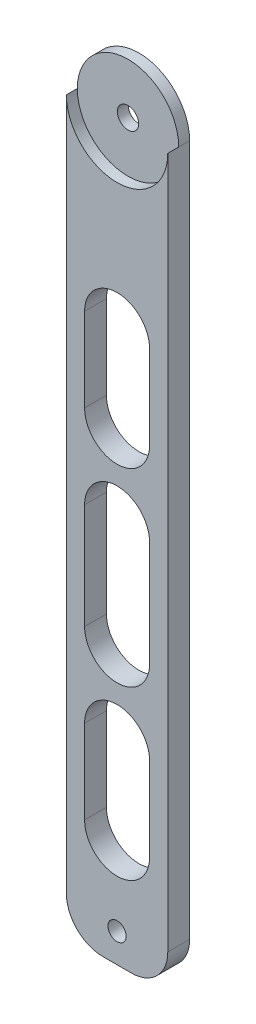
ISO-10303-21;
HEADER;
FILE_DESCRIPTION(('STEP AP214'),'2;1');
FILE_NAME('part.step','',(''),(''),'','','');
FILE_SCHEMA(('AUTOMOTIVE_DESIGN { 1 0 10303 214 1 1 1 1 }'));
ENDSEC;
DATA;
#1=APPLICATION_CONTEXT('core data for automotive mechanical design processes');
#2=APPLICATION_PROTOCOL_DEFINITION('international standard','automotive_design',2000,#1);
#3=PRODUCT_CONTEXT('',#1,'mechanical');
#4=PRODUCT('Part','Part','',(#3));
#5=PRODUCT_RELATED_PRODUCT_CATEGORY('part','',(#4));
#6=PRODUCT_DEFINITION_FORMATION('','',#4);
#7=PRODUCT_DEFINITION_CONTEXT('part definition',#1,'design');
#8=PRODUCT_DEFINITION('design','',#6,#7);
#9=PRODUCT_DEFINITION_SHAPE('','',#8);
#10=(LENGTH_UNIT() NAMED_UNIT(*) SI_UNIT(.MILLI.,.METRE.));
#11=(NAMED_UNIT(*) PLANE_ANGLE_UNIT() SI_UNIT($,.RADIAN.));
#12=(NAMED_UNIT(*) SI_UNIT($,.STERADIAN.) SOLID_ANGLE_UNIT());
#13=UNCERTAINTY_MEASURE_WITH_UNIT(LENGTH_MEASURE(1.E-05),#10,'distance_accuracy_value','');
#14=(GEOMETRIC_REPRESENTATION_CONTEXT(3) GLOBAL_UNCERTAINTY_ASSIGNED_CONTEXT((#13)) GLOBAL_UNIT_ASSIGNED_CONTEXT((#10,
#11,#12)) REPRESENTATION_CONTEXT('',''));
#15=CARTESIAN_POINT('',(0.,0.,0.));
#16=DIRECTION('',(0.,0.,1.));
#17=DIRECTION('',(1.,0.,0.));
#18=AXIS2_PLACEMENT_3D('',#15,#16,#17);
#19=CARTESIAN_POINT('',(5.76007751937987,-168.788662790698,6.));
#20=DIRECTION('',(0.,0.,1.));
#21=DIRECTION('',(1.,0.,0.));
#22=AXIS2_PLACEMENT_3D('',#19,#20,#21);
#23=CYLINDRICAL_SURFACE('',#22,10.);
#24=DIRECTION('',(0.,0.,-1.));
#25=VECTOR('',#24,1.);
#26=CARTESIAN_POINT('',(15.7600775193799,-168.788662790698,6.));
#27=LINE('',#26,#25);
#28=CARTESIAN_POINT('',(15.7600775193799,-168.788662790698,6.));
#29=VERTEX_POINT('',#28);
#30=CARTESIAN_POINT('',(15.7600775193799,-168.788662790698,0.));
#31=VERTEX_POINT('',#30);
#32=EDGE_CURVE('E323',#29,#31,#27,.T.);
#33=ORIENTED_EDGE('',*,*,#32,.F.);
#34=CARTESIAN_POINT('',(5.76007751937987,-168.788662790698,6.));
#35=DIRECTION('',(0.,0.,1.));
#36=DIRECTION('',(1.,0.,0.));
#37=AXIS2_PLACEMENT_3D('',#34,#35,#36);
#38=CIRCLE('',#37,10.);
#39=CARTESIAN_POINT('',(5.76007751937987,-178.788662790698,6.));
#40=VERTEX_POINT('',#39);
#41=EDGE_CURVE('E42',#40,#29,#38,.T.);
#42=ORIENTED_EDGE('',*,*,#41,.F.);
#43=DIRECTION('',(0.,0.,-1.));
#44=VECTOR('',#43,1.);
#45=CARTESIAN_POINT('',(5.76007751937987,-178.788662790698,6.));
#46=LINE('',#45,#44);
#47=CARTESIAN_POINT('',(5.76007751937987,-178.788662790698,0.));
#48=VERTEX_POINT('',#47);
#49=EDGE_CURVE('E326',#48,#40,#46,.F.);
#50=ORIENTED_EDGE('',*,*,#49,.F.);
#51=CARTESIAN_POINT('',(5.76007751937987,-168.788662790698,0.));
#52=DIRECTION('',(0.,0.,1.));
#53=DIRECTION('',(1.,0.,0.));
#54=AXIS2_PLACEMENT_3D('',#51,#52,#53);
#55=CIRCLE('',#54,10.);
#56=EDGE_CURVE('E11',#31,#48,#55,.F.);
#57=ORIENTED_EDGE('',*,*,#56,.F.);
#58=EDGE_LOOP('',(#33,#42,#50,#57));
#59=FACE_BOUND('',#58,.T.);
#60=ADVANCED_FACE('F35',(#59),#23,.T.);
#61=CARTESIAN_POINT('',(-2.08992248062013,-168.788662790698,6.));
#62=DIRECTION('',(0.,0.,1.));
#63=DIRECTION('',(1.,0.,0.));
#64=AXIS2_PLACEMENT_3D('',#61,#62,#63);
#65=CYLINDRICAL_SURFACE('',#64,10.);
#66=DIRECTION('',(0.,0.,1.));
#67=VECTOR('',#66,1.);
#68=CARTESIAN_POINT('',(-12.0899224806201,-168.788662790698,6.));
#69=LINE('',#68,#67);
#70=CARTESIAN_POINT('',(-12.0899224806201,-168.788662790698,0.));
#71=VERTEX_POINT('',#70);
#72=CARTESIAN_POINT('',(-12.0899224806201,-168.788662790698,6.));
#73=VERTEX_POINT('',#72);
#74=EDGE_CURVE('E313',#71,#73,#69,.T.);
#75=ORIENTED_EDGE('',*,*,#74,.F.);
#76=CARTESIAN_POINT('',(-2.08992248062013,-168.788662790698,0.));
#77=DIRECTION('',(0.,0.,1.));
#78=DIRECTION('',(1.,0.,0.));
#79=AXIS2_PLACEMENT_3D('',#76,#77,#78);
#80=CIRCLE('',#79,10.);
#81=CARTESIAN_POINT('',(-2.08992248062013,-178.788662790698,0.));
#82=VERTEX_POINT('',#81);
#83=EDGE_CURVE('E319',#82,#71,#80,.F.);
#84=ORIENTED_EDGE('',*,*,#83,.F.);
#85=DIRECTION('',(0.,0.,1.));
#86=VECTOR('',#85,1.);
#87=CARTESIAN_POINT('',(-2.08992248062013,-178.788662790698,6.));
#88=LINE('',#87,#86);
#89=CARTESIAN_POINT('',(-2.08992248062013,-178.788662790698,6.));
#90=VERTEX_POINT('',#89);
#91=EDGE_CURVE('E316',#90,#82,#88,.F.);
#92=ORIENTED_EDGE('',*,*,#91,.F.);
#93=CARTESIAN_POINT('',(-2.08992248062013,-168.788662790698,6.));
#94=DIRECTION('',(0.,0.,1.));
#95=DIRECTION('',(1.,0.,0.));
#96=AXIS2_PLACEMENT_3D('',#93,#94,#95);
#97=CIRCLE('',#96,10.);
#98=EDGE_CURVE('E321',#73,#90,#97,.T.);
#99=ORIENTED_EDGE('',*,*,#98,.F.);
#100=EDGE_LOOP('',(#75,#84,#92,#99));
#101=FACE_BOUND('',#100,.T.);
#102=ADVANCED_FACE('F354',(#101),#65,.T.);
#103=CARTESIAN_POINT('',(0.,0.,6.));
#104=DIRECTION('',(0.,0.,1.));
#105=DIRECTION('',(1.,0.,0.));
#106=AXIS2_PLACEMENT_3D('',#103,#104,#105);
#107=PLANE('',#106);
#108=CARTESIAN_POINT('',(1.83507751937984,-125.788662790698,6.));
#109=DIRECTION('',(0.,0.,1.));
#110=DIRECTION('',(1.,0.,0.));
#111=AXIS2_PLACEMENT_3D('',#108,#109,#110);
#112=CIRCLE('',#111,8.925);
#113=CARTESIAN_POINT('',(10.7600775193798,-125.788662790698,6.));
#114=VERTEX_POINT('',#113);
#115=CARTESIAN_POINT('',(-7.08992248062015,-125.788662790698,6.));
#116=VERTEX_POINT('',#115);
#117=EDGE_CURVE('E184',#114,#116,#112,.T.);
#118=ORIENTED_EDGE('',*,*,#117,.F.);
#119=DIRECTION('',(0.,-1.,0.));
#120=VECTOR('',#119,1.);
#121=CARTESIAN_POINT('',(10.7600775193798,0.,6.));
#122=LINE('',#121,#120);
#123=CARTESIAN_POINT('',(10.7600775193798,-148.788662790698,6.));
#124=VERTEX_POINT('',#123);
#125=EDGE_CURVE('E189',#114,#124,#122,.T.);
#126=ORIENTED_EDGE('',*,*,#125,.T.);
#127=CARTESIAN_POINT('',(1.83507751937985,-148.788662790698,6.));
#128=DIRECTION('',(0.,0.,1.));
#129=DIRECTION('',(1.,0.,0.));
#130=AXIS2_PLACEMENT_3D('',#127,#128,#129);
#131=CIRCLE('',#130,8.925);
#132=CARTESIAN_POINT('',(-7.08992248062015,-148.788662790698,6.));
#133=VERTEX_POINT('',#132);
#134=EDGE_CURVE('E168',#133,#124,#131,.T.);
#135=ORIENTED_EDGE('',*,*,#134,.F.);
#136=DIRECTION('',(0.,-1.,0.));
#137=VECTOR('',#136,1.);
#138=CARTESIAN_POINT('',(-7.08992248062018,0.,6.));
#139=LINE('',#138,#137);
#140=EDGE_CURVE('E179',#116,#133,#139,.T.);
#141=ORIENTED_EDGE('',*,*,#140,.F.);
#142=EDGE_LOOP('',(#118,#126,#135,#141));
#143=FACE_BOUND('',#142,.T.);
#144=CARTESIAN_POINT('',(1.83507751937984,-27.7886627906977,6.));
#145=DIRECTION('',(0.,0.,1.));
#146=DIRECTION('',(1.,0.,0.));
#147=AXIS2_PLACEMENT_3D('',#144,#145,#146);
#148=CIRCLE('',#147,8.925);
#149=CARTESIAN_POINT('',(10.7600775193798,-27.7886627906977,6.));
#150=VERTEX_POINT('',#149);
#151=CARTESIAN_POINT('',(-7.08992248062015,-27.7886627906977,6.));
#152=VERTEX_POINT('',#151);
#153=EDGE_CURVE('E213',#150,#152,#148,.T.);
#154=ORIENTED_EDGE('',*,*,#153,.F.);
#155=DIRECTION('',(0.,-1.,0.));
#156=VECTOR('',#155,1.);
#157=CARTESIAN_POINT('',(10.7600775193798,0.,6.));
#158=LINE('',#157,#156);
#159=CARTESIAN_POINT('',(10.7600775193798,-50.7886627906977,6.));
#160=VERTEX_POINT('',#159);
#161=EDGE_CURVE('E227',#150,#160,#158,.T.);
#162=ORIENTED_EDGE('',*,*,#161,.T.);
#163=CARTESIAN_POINT('',(1.83507751937985,-50.7886627906977,6.));
#164=DIRECTION('',(0.,0.,1.));
#165=DIRECTION('',(1.,0.,0.));
#166=AXIS2_PLACEMENT_3D('',#163,#164,#165);
#167=CIRCLE('',#166,8.925);
#168=CARTESIAN_POINT('',(-7.08992248062015,-50.7886627906977,6.));
#169=VERTEX_POINT('',#168);
#170=EDGE_CURVE('E224',#169,#160,#167,.T.);
#171=ORIENTED_EDGE('',*,*,#170,.F.);
#172=DIRECTION('',(0.,-1.,0.));
#173=VECTOR('',#172,1.);
#174=CARTESIAN_POINT('',(-7.08992248062016,0.,6.));
#175=LINE('',#174,#173);
#176=EDGE_CURVE('E221',#152,#169,#175,.T.);
#177=ORIENTED_EDGE('',*,*,#176,.F.);
#178=EDGE_LOOP('',(#154,#162,#171,#177));
#179=FACE_BOUND('',#178,.T.);
#180=DIRECTION('',(1.,0.,0.));
#181=VECTOR('',#180,1.);
#182=CARTESIAN_POINT('',(0.,-178.788662790698,6.));
#183=LINE('',#182,#181);
#184=EDGE_CURVE('E263',#90,#40,#183,.T.);
#185=ORIENTED_EDGE('',*,*,#184,.T.);
#186=ORIENTED_EDGE('',*,*,#41,.T.);
#187=DIRECTION('',(0.,-1.,0.));
#188=VECTOR('',#187,1.);
#189=CARTESIAN_POINT('',(15.7600775193798,0.,6.));
#190=LINE('',#189,#188);
#191=CARTESIAN_POINT('',(15.7600775193798,21.2113372093023,6.));
#192=VERTEX_POINT('',#191);
#193=EDGE_CURVE('E256',#192,#29,#190,.T.);
#194=ORIENTED_EDGE('',*,*,#193,.F.);
#195=CARTESIAN_POINT('',(1.83507751937984,21.2113372093023,6.));
#196=DIRECTION('',(0.,0.,1.));
#197=DIRECTION('',(1.,0.,0.));
#198=AXIS2_PLACEMENT_3D('',#195,#196,#197);
#199=CIRCLE('',#198,13.925);
#200=CARTESIAN_POINT('',(-12.0899224806202,21.2113372093023,6.));
#201=VERTEX_POINT('',#200);
#202=EDGE_CURVE('E282',#201,#192,#199,.T.);
#203=ORIENTED_EDGE('',*,*,#202,.F.);
#204=DIRECTION('',(0.,-1.,0.));
#205=VECTOR('',#204,1.);
#206=CARTESIAN_POINT('',(-12.0899224806202,0.,6.));
#207=LINE('',#206,#205);
#208=EDGE_CURVE('E259',#201,#73,#207,.T.);
#209=ORIENTED_EDGE('',*,*,#208,.T.);
#210=ORIENTED_EDGE('',*,*,#98,.T.);
#211=EDGE_LOOP('',(#185,#186,#194,#203,#209,#210));
#212=FACE_BOUND('',#211,.T.);
#213=CARTESIAN_POINT('',(1.83507751937984,-170.788662790698,6.));
#214=DIRECTION('',(0.,0.,1.));
#215=DIRECTION('',(1.,0.,0.));
#216=AXIS2_PLACEMENT_3D('',#213,#214,#215);
#217=CIRCLE('',#216,2.5);
#218=CARTESIAN_POINT('',(4.33507751937984,-170.788662790698,6.));
#219=VERTEX_POINT('',#218);
#220=EDGE_CURVE('E249',#219,#219,#217,.T.);
#221=ORIENTED_EDGE('',*,*,#220,.F.);
#222=EDGE_LOOP('',(#221));
#223=FACE_BOUND('',#222,.T.);
#224=DIRECTION('',(0.,-1.,0.));
#225=VECTOR('',#224,1.);
#226=CARTESIAN_POINT('',(-7.08992248062017,0.,6.));
#227=LINE('',#226,#225);
#228=CARTESIAN_POINT('',(-7.08992248062015,-73.7886627906977,6.));
#229=VERTEX_POINT('',#228);
#230=CARTESIAN_POINT('',(-7.08992248062015,-102.788662790698,6.));
#231=VERTEX_POINT('',#230);
#232=EDGE_CURVE('E201',#229,#231,#227,.T.);
#233=ORIENTED_EDGE('',*,*,#232,.F.);
#234=CARTESIAN_POINT('',(1.83507751937984,-73.7886627906977,6.));
#235=DIRECTION('',(0.,0.,1.));
#236=DIRECTION('',(1.,0.,0.));
#237=AXIS2_PLACEMENT_3D('',#234,#235,#236);
#238=CIRCLE('',#237,8.925);
#239=CARTESIAN_POINT('',(10.7600775193798,-73.7886627906977,6.));
#240=VERTEX_POINT('',#239);
#241=EDGE_CURVE('E196',#229,#240,#238,.F.);
#242=ORIENTED_EDGE('',*,*,#241,.T.);
#243=DIRECTION('',(0.,-1.,0.));
#244=VECTOR('',#243,1.);
#245=CARTESIAN_POINT('',(10.7600775193798,0.,6.));
#246=LINE('',#245,#244);
#247=CARTESIAN_POINT('',(10.7600775193798,-102.788662790698,6.));
#248=VERTEX_POINT('',#247);
#249=EDGE_CURVE('E207',#240,#248,#246,.T.);
#250=ORIENTED_EDGE('',*,*,#249,.T.);
#251=CARTESIAN_POINT('',(1.83507751937985,-102.788662790698,6.));
#252=DIRECTION('',(0.,0.,1.));
#253=DIRECTION('',(1.,0.,0.));
#254=AXIS2_PLACEMENT_3D('',#251,#252,#253);
#255=CIRCLE('',#254,8.925);
#256=EDGE_CURVE('E204',#231,#248,#255,.T.);
#257=ORIENTED_EDGE('',*,*,#256,.F.);
#258=EDGE_LOOP('',(#233,#242,#250,#257));
#259=FACE_BOUND('',#258,.T.);
#260=ADVANCED_FACE('F186',(#143,#179,#212,#223,#259),#107,.T.);
#261=CARTESIAN_POINT('',(0.,0.,0.));
#262=DIRECTION('',(0.,0.,1.));
#263=DIRECTION('',(1.,0.,0.));
#264=AXIS2_PLACEMENT_3D('',#261,#262,#263);
#265=PLANE('',#264);
#266=DIRECTION('',(0.,-1.,0.));
#267=VECTOR('',#266,1.);
#268=CARTESIAN_POINT('',(10.7600775193798,0.,0.));
#269=LINE('',#268,#267);
#270=CARTESIAN_POINT('',(10.7600775193798,-125.788662790698,0.));
#271=VERTEX_POINT('',#270);
#272=CARTESIAN_POINT('',(10.7600775193798,-148.788662790698,0.));
#273=VERTEX_POINT('',#272);
#274=EDGE_CURVE('E308',#271,#273,#269,.T.);
#275=ORIENTED_EDGE('',*,*,#274,.F.);
#276=CARTESIAN_POINT('',(1.83507751937984,-125.788662790698,0.));
#277=DIRECTION('',(0.,0.,1.));
#278=DIRECTION('',(1.,0.,0.));
#279=AXIS2_PLACEMENT_3D('',#276,#277,#278);
#280=CIRCLE('',#279,8.925);
#281=CARTESIAN_POINT('',(-7.08992248062015,-125.788662790698,0.));
#282=VERTEX_POINT('',#281);
#283=EDGE_CURVE('E310',#271,#282,#280,.T.);
#284=ORIENTED_EDGE('',*,*,#283,.T.);
#285=DIRECTION('',(0.,-1.,0.));
#286=VECTOR('',#285,1.);
#287=CARTESIAN_POINT('',(-7.08992248062018,0.,0.));
#288=LINE('',#287,#286);
#289=CARTESIAN_POINT('',(-7.08992248062015,-148.788662790698,0.));
#290=VERTEX_POINT('',#289);
#291=EDGE_CURVE('E305',#282,#290,#288,.T.);
#292=ORIENTED_EDGE('',*,*,#291,.T.);
#293=CARTESIAN_POINT('',(1.83507751937985,-148.788662790698,0.));
#294=DIRECTION('',(0.,0.,1.));
#295=DIRECTION('',(1.,0.,0.));
#296=AXIS2_PLACEMENT_3D('',#293,#294,#295);
#297=CIRCLE('',#296,8.925);
#298=EDGE_CURVE('E171',#290,#273,#297,.T.);
#299=ORIENTED_EDGE('',*,*,#298,.T.);
#300=EDGE_LOOP('',(#275,#284,#292,#299));
#301=FACE_BOUND('',#300,.T.);
#302=DIRECTION('',(0.,-1.,0.));
#303=VECTOR('',#302,1.);
#304=CARTESIAN_POINT('',(15.7600775193798,0.,0.));
#305=LINE('',#304,#303);
#306=CARTESIAN_POINT('',(15.7600775193798,21.2113372093023,0.));
#307=VERTEX_POINT('',#306);
#308=EDGE_CURVE('E253',#307,#31,#305,.T.);
#309=ORIENTED_EDGE('',*,*,#308,.T.);
#310=ORIENTED_EDGE('',*,*,#56,.T.);
#311=DIRECTION('',(1.,0.,0.));
#312=VECTOR('',#311,1.);
#313=CARTESIAN_POINT('',(0.,-178.788662790698,0.));
#314=LINE('',#313,#312);
#315=EDGE_CURVE('E260',#82,#48,#314,.T.);
#316=ORIENTED_EDGE('',*,*,#315,.F.);
#317=ORIENTED_EDGE('',*,*,#83,.T.);
#318=DIRECTION('',(0.,-1.,0.));
#319=VECTOR('',#318,1.);
#320=CARTESIAN_POINT('',(-12.0899224806202,0.,0.));
#321=LINE('',#320,#319);
#322=CARTESIAN_POINT('',(-12.0899224806202,21.2113372093023,0.));
#323=VERTEX_POINT('',#322);
#324=EDGE_CURVE('E271',#323,#71,#321,.T.);
#325=ORIENTED_EDGE('',*,*,#324,.F.);
#326=CARTESIAN_POINT('',(1.83507751937984,21.2113372093023,0.));
#327=DIRECTION('',(0.,0.,1.));
#328=DIRECTION('',(1.,0.,0.));
#329=AXIS2_PLACEMENT_3D('',#326,#327,#328);
#330=CIRCLE('',#329,13.925);
#331=EDGE_CURVE('E268',#307,#323,#330,.T.);
#332=ORIENTED_EDGE('',*,*,#331,.F.);
#333=EDGE_LOOP('',(#309,#310,#316,#317,#325,#332));
#334=FACE_BOUND('',#333,.T.);
#335=CARTESIAN_POINT('',(1.83507751937984,-170.788662790698,0.));
#336=DIRECTION('',(0.,0.,1.));
#337=DIRECTION('',(1.,0.,0.));
#338=AXIS2_PLACEMENT_3D('',#335,#336,#337);
#339=CIRCLE('',#338,2.5);
#340=CARTESIAN_POINT('',(4.33507751937984,-170.788662790698,0.));
#341=VERTEX_POINT('',#340);
#342=EDGE_CURVE('E250',#341,#341,#339,.T.);
#343=ORIENTED_EDGE('',*,*,#342,.T.);
#344=EDGE_LOOP('',(#343));
#345=FACE_BOUND('',#344,.T.);
#346=CARTESIAN_POINT('',(1.83507751937984,21.2113372093023,0.));
#347=DIRECTION('',(0.,0.,1.));
#348=DIRECTION('',(1.,0.,0.));
#349=AXIS2_PLACEMENT_3D('',#346,#347,#348);
#350=CIRCLE('',#349,2.925);
#351=CARTESIAN_POINT('',(4.76007751937984,21.2113372093023,0.));
#352=VERTEX_POINT('',#351);
#353=EDGE_CURVE('E240',#352,#352,#350,.T.);
#354=ORIENTED_EDGE('',*,*,#353,.T.);
#355=EDGE_LOOP('',(#354));
#356=FACE_BOUND('',#355,.T.);
#357=DIRECTION('',(0.,-1.,0.));
#358=VECTOR('',#357,1.);
#359=CARTESIAN_POINT('',(10.7600775193798,0.,0.));
#360=LINE('',#359,#358);
#361=CARTESIAN_POINT('',(10.7600775193798,-27.7886627906977,0.));
#362=VERTEX_POINT('',#361);
#363=CARTESIAN_POINT('',(10.7600775193798,-50.7886627906977,0.));
#364=VERTEX_POINT('',#363);
#365=EDGE_CURVE('E290',#362,#364,#360,.T.);
#366=ORIENTED_EDGE('',*,*,#365,.F.);
#367=CARTESIAN_POINT('',(1.83507751937984,-27.7886627906977,0.));
#368=DIRECTION('',(0.,0.,1.));
#369=DIRECTION('',(1.,0.,0.));
#370=AXIS2_PLACEMENT_3D('',#367,#368,#369);
#371=CIRCLE('',#370,8.925);
#372=CARTESIAN_POINT('',(-7.08992248062015,-27.7886627906977,0.));
#373=VERTEX_POINT('',#372);
#374=EDGE_CURVE('E292',#362,#373,#371,.T.);
#375=ORIENTED_EDGE('',*,*,#374,.T.);
#376=DIRECTION('',(0.,-1.,0.));
#377=VECTOR('',#376,1.);
#378=CARTESIAN_POINT('',(-7.08992248062016,0.,0.));
#379=LINE('',#378,#377);
#380=CARTESIAN_POINT('',(-7.08992248062015,-50.7886627906977,0.));
#381=VERTEX_POINT('',#380);
#382=EDGE_CURVE('E284',#373,#381,#379,.T.);
#383=ORIENTED_EDGE('',*,*,#382,.T.);
#384=CARTESIAN_POINT('',(1.83507751937985,-50.7886627906977,0.));
#385=DIRECTION('',(0.,0.,1.));
#386=DIRECTION('',(1.,0.,0.));
#387=AXIS2_PLACEMENT_3D('',#384,#385,#386);
#388=CIRCLE('',#387,8.925);
#389=EDGE_CURVE('E287',#381,#364,#388,.T.);
#390=ORIENTED_EDGE('',*,*,#389,.T.);
#391=EDGE_LOOP('',(#366,#375,#383,#390));
#392=FACE_BOUND('',#391,.T.);
#393=CARTESIAN_POINT('',(1.83507751937984,-73.7886627906977,0.));
#394=DIRECTION('',(0.,0.,1.));
#395=DIRECTION('',(1.,0.,0.));
#396=AXIS2_PLACEMENT_3D('',#393,#394,#395);
#397=CIRCLE('',#396,8.925);
#398=CARTESIAN_POINT('',(-7.08992248062015,-73.7886627906977,0.));
#399=VERTEX_POINT('',#398);
#400=CARTESIAN_POINT('',(10.7600775193798,-73.7886627906977,0.));
#401=VERTEX_POINT('',#400);
#402=EDGE_CURVE('E303',#399,#401,#397,.F.);
#403=ORIENTED_EDGE('',*,*,#402,.F.);
#404=DIRECTION('',(0.,-1.,0.));
#405=VECTOR('',#404,1.);
#406=CARTESIAN_POINT('',(-7.08992248062017,0.,0.));
#407=LINE('',#406,#405);
#408=CARTESIAN_POINT('',(-7.08992248062015,-102.788662790698,0.));
#409=VERTEX_POINT('',#408);
#410=EDGE_CURVE('E295',#399,#409,#407,.T.);
#411=ORIENTED_EDGE('',*,*,#410,.T.);
#412=CARTESIAN_POINT('',(1.83507751937985,-102.788662790698,0.));
#413=DIRECTION('',(0.,0.,1.));
#414=DIRECTION('',(1.,0.,0.));
#415=AXIS2_PLACEMENT_3D('',#412,#413,#414);
#416=CIRCLE('',#415,8.925);
#417=CARTESIAN_POINT('',(10.7600775193798,-102.788662790698,0.));
#418=VERTEX_POINT('',#417);
#419=EDGE_CURVE('E298',#409,#418,#416,.T.);
#420=ORIENTED_EDGE('',*,*,#419,.T.);
#421=DIRECTION('',(0.,-1.,0.));
#422=VECTOR('',#421,1.);
#423=CARTESIAN_POINT('',(10.7600775193798,0.,0.));
#424=LINE('',#423,#422);
#425=EDGE_CURVE('E301',#401,#418,#424,.T.);
#426=ORIENTED_EDGE('',*,*,#425,.F.);
#427=EDGE_LOOP('',(#403,#411,#420,#426));
#428=FACE_BOUND('',#427,.T.);
#429=ADVANCED_FACE('F357',(#301,#334,#345,#356,#392,#428),#265,.F.);
#430=CARTESIAN_POINT('',(1.83507751937984,21.2113372093023,6.));
#431=DIRECTION('',(0.,0.,-1.));
#432=DIRECTION('',(-1.,0.,0.));
#433=AXIS2_PLACEMENT_3D('',#430,#431,#432);
#434=CYLINDRICAL_SURFACE('',#433,13.925);
#435=CARTESIAN_POINT('',(1.83507751937984,21.2113372093023,3.));
#436=DIRECTION('',(0.,0.,1.));
#437=DIRECTION('',(1.,0.,0.));
#438=AXIS2_PLACEMENT_3D('',#435,#436,#437);
#439=CIRCLE('',#438,13.925);
#440=CARTESIAN_POINT('',(15.7600775193798,21.2113372093023,3.));
#441=VERTEX_POINT('',#440);
#442=CARTESIAN_POINT('',(-12.0899224806202,21.2113372093023,3.));
#443=VERTEX_POINT('',#442);
#444=EDGE_CURVE('E246',#441,#443,#439,.T.);
#445=ORIENTED_EDGE('',*,*,#444,.F.);
#446=DIRECTION('',(0.,0.,-1.));
#447=VECTOR('',#446,1.);
#448=CARTESIAN_POINT('',(15.7600775193798,21.2113372093023,6.));
#449=LINE('',#448,#447);
#450=EDGE_CURVE('E279',#441,#307,#449,.T.);
#451=ORIENTED_EDGE('',*,*,#450,.T.);
#452=ORIENTED_EDGE('',*,*,#331,.T.);
#453=DIRECTION('',(0.,0.,-1.));
#454=VECTOR('',#453,1.);
#455=CARTESIAN_POINT('',(-12.0899224806202,21.2113372093023,6.));
#456=LINE('',#455,#454);
#457=EDGE_CURVE('E266',#443,#323,#456,.T.);
#458=ORIENTED_EDGE('',*,*,#457,.F.);
#459=EDGE_LOOP('',(#445,#451,#452,#458));
#460=FACE_BOUND('',#459,.T.);
#461=ADVANCED_FACE('F345',(#460),#434,.T.);
#462=CARTESIAN_POINT('',(15.7600775193798,0.,6.));
#463=DIRECTION('',(1.,0.,0.));
#464=DIRECTION('',(0.,1.,0.));
#465=AXIS2_PLACEMENT_3D('',#462,#463,#464);
#466=PLANE('',#465);
#467=ORIENTED_EDGE('',*,*,#193,.T.);
#468=ORIENTED_EDGE('',*,*,#32,.T.);
#469=ORIENTED_EDGE('',*,*,#308,.F.);
#470=ORIENTED_EDGE('',*,*,#450,.F.);
#471=EDGE_CURVE('E280',#192,#441,#449,.T.);
#472=ORIENTED_EDGE('',*,*,#471,.F.);
#473=EDGE_LOOP('',(#467,#468,#469,#470,#472));
#474=FACE_BOUND('',#473,.T.);
#475=ADVANCED_FACE('F335',(#474),#466,.T.);
#476=CARTESIAN_POINT('',(-12.0899224806202,0.,6.));
#477=DIRECTION('',(1.,0.,0.));
#478=DIRECTION('',(0.,1.,0.));
#479=AXIS2_PLACEMENT_3D('',#476,#477,#478);
#480=PLANE('',#479);
#481=ORIENTED_EDGE('',*,*,#324,.T.);
#482=ORIENTED_EDGE('',*,*,#74,.T.);
#483=ORIENTED_EDGE('',*,*,#208,.F.);
#484=EDGE_CURVE('E276',#201,#443,#456,.T.);
#485=ORIENTED_EDGE('',*,*,#484,.T.);
#486=ORIENTED_EDGE('',*,*,#457,.T.);
#487=EDGE_LOOP('',(#481,#482,#483,#485,#486));
#488=FACE_BOUND('',#487,.T.);
#489=ADVANCED_FACE('F350',(#488),#480,.F.);
#490=CARTESIAN_POINT('',(0.,-178.788662790698,6.));
#491=DIRECTION('',(0.,1.,0.));
#492=DIRECTION('',(0.,0.,1.));
#493=AXIS2_PLACEMENT_3D('',#490,#491,#492);
#494=PLANE('',#493);
#495=ORIENTED_EDGE('',*,*,#315,.T.);
#496=ORIENTED_EDGE('',*,*,#49,.T.);
#497=ORIENTED_EDGE('',*,*,#184,.F.);
#498=ORIENTED_EDGE('',*,*,#91,.T.);
#499=EDGE_LOOP('',(#495,#496,#497,#498));
#500=FACE_BOUND('',#499,.T.);
#501=ADVANCED_FACE('F356',(#500),#494,.F.);
#502=CARTESIAN_POINT('',(1.83507751937984,-170.788662790698,0.));
#503=DIRECTION('',(0.,0.,1.));
#504=DIRECTION('',(1.,0.,0.));
#505=AXIS2_PLACEMENT_3D('',#502,#503,#504);
#506=CYLINDRICAL_SURFACE('',#505,2.5);
#507=ORIENTED_EDGE('',*,*,#342,.F.);
#508=EDGE_LOOP('',(#507));
#509=FACE_BOUND('',#508,.T.);
#510=ORIENTED_EDGE('',*,*,#220,.T.);
#511=EDGE_LOOP('',(#510));
#512=FACE_BOUND('',#511,.T.);
#513=ADVANCED_FACE('F411',(#509,#512),#506,.F.);
#514=CARTESIAN_POINT('',(1.83507751937984,21.2113372093023,3.));
#515=DIRECTION('',(0.,0.,1.));
#516=DIRECTION('',(1.,0.,0.));
#517=AXIS2_PLACEMENT_3D('',#514,#515,#516);
#518=CYLINDRICAL_SURFACE('',#517,13.925);
#519=EDGE_CURVE('E243',#443,#441,#439,.T.);
#520=ORIENTED_EDGE('',*,*,#519,.F.);
#521=ORIENTED_EDGE('',*,*,#484,.F.);
#522=ORIENTED_EDGE('',*,*,#202,.T.);
#523=ORIENTED_EDGE('',*,*,#471,.T.);
#524=EDGE_LOOP('',(#520,#521,#522,#523));
#525=FACE_BOUND('',#524,.T.);
#526=ADVANCED_FACE('F339',(#525),#518,.F.);
#527=CARTESIAN_POINT('',(1.83507751937984,21.2113372093023,3.));
#528=DIRECTION('',(0.,0.,1.));
#529=DIRECTION('',(1.,0.,0.));
#530=AXIS2_PLACEMENT_3D('',#527,#528,#529);
#531=PLANE('',#530);
#532=CARTESIAN_POINT('',(1.83507751937984,21.2113372093023,3.));
#533=DIRECTION('',(0.,0.,1.));
#534=DIRECTION('',(1.,0.,0.));
#535=AXIS2_PLACEMENT_3D('',#532,#533,#534);
#536=CIRCLE('',#535,2.925);
#537=CARTESIAN_POINT('',(4.76007751937984,21.2113372093023,3.));
#538=VERTEX_POINT('',#537);
#539=EDGE_CURVE('E233',#538,#538,#536,.T.);
#540=ORIENTED_EDGE('',*,*,#539,.F.);
#541=EDGE_LOOP('',(#540));
#542=FACE_BOUND('',#541,.T.);
#543=ORIENTED_EDGE('',*,*,#444,.T.);
#544=ORIENTED_EDGE('',*,*,#519,.T.);
#545=EDGE_LOOP('',(#543,#544));
#546=FACE_BOUND('',#545,.T.);
#547=ADVANCED_FACE('F342',(#542,#546),#531,.T.);
#548=CARTESIAN_POINT('',(1.83507751937984,21.2113372093023,0.));
#549=DIRECTION('',(0.,0.,1.));
#550=DIRECTION('',(1.,0.,0.));
#551=AXIS2_PLACEMENT_3D('',#548,#549,#550);
#552=CYLINDRICAL_SURFACE('',#551,2.925);
#553=ORIENTED_EDGE('',*,*,#353,.F.);
#554=EDGE_LOOP('',(#553));
#555=FACE_BOUND('',#554,.T.);
#556=ORIENTED_EDGE('',*,*,#539,.T.);
#557=EDGE_LOOP('',(#556));
#558=FACE_BOUND('',#557,.T.);
#559=ADVANCED_FACE('F420',(#555,#558),#552,.F.);
#560=CARTESIAN_POINT('',(1.83507751937984,-27.7886627906977,-4.));
#561=DIRECTION('',(0.,0.,1.));
#562=DIRECTION('',(1.,0.,0.));
#563=AXIS2_PLACEMENT_3D('',#560,#561,#562);
#564=CYLINDRICAL_SURFACE('',#563,8.925);
#565=DIRECTION('',(0.,0.,1.));
#566=VECTOR('',#565,1.);
#567=CARTESIAN_POINT('',(10.7600775193798,-27.7886627906977,-4.));
#568=LINE('',#567,#566);
#569=EDGE_CURVE('E231',#362,#150,#568,.T.);
#570=ORIENTED_EDGE('',*,*,#569,.T.);
#571=ORIENTED_EDGE('',*,*,#153,.T.);
#572=DIRECTION('',(0.,0.,1.));
#573=VECTOR('',#572,1.);
#574=CARTESIAN_POINT('',(-7.08992248062015,-27.7886627906977,-4.));
#575=LINE('',#574,#573);
#576=EDGE_CURVE('E230',#373,#152,#575,.T.);
#577=ORIENTED_EDGE('',*,*,#576,.F.);
#578=ORIENTED_EDGE('',*,*,#374,.F.);
#579=EDGE_LOOP('',(#570,#571,#577,#578));
#580=FACE_BOUND('',#579,.T.);
#581=ADVANCED_FACE('F424',(#580),#564,.F.);
#582=CARTESIAN_POINT('',(10.7600775193798,0.,-4.));
#583=DIRECTION('',(-1.,0.,0.));
#584=DIRECTION('',(0.,0.,1.));
#585=AXIS2_PLACEMENT_3D('',#582,#583,#584);
#586=PLANE('',#585);
#587=ORIENTED_EDGE('',*,*,#365,.T.);
#588=DIRECTION('',(0.,0.,1.));
#589=VECTOR('',#588,1.);
#590=CARTESIAN_POINT('',(10.7600775193798,-50.7886627906977,-4.));
#591=LINE('',#590,#589);
#592=EDGE_CURVE('E234',#364,#160,#591,.T.);
#593=ORIENTED_EDGE('',*,*,#592,.T.);
#594=ORIENTED_EDGE('',*,*,#161,.F.);
#595=ORIENTED_EDGE('',*,*,#569,.F.);
#596=EDGE_LOOP('',(#587,#593,#594,#595));
#597=FACE_BOUND('',#596,.T.);
#598=ADVANCED_FACE('F428',(#597),#586,.T.);
#599=CARTESIAN_POINT('',(1.83507751937985,-50.7886627906977,-4.));
#600=DIRECTION('',(0.,0.,1.));
#601=DIRECTION('',(1.,0.,0.));
#602=AXIS2_PLACEMENT_3D('',#599,#600,#601);
#603=CYLINDRICAL_SURFACE('',#602,8.925);
#604=DIRECTION('',(0.,0.,1.));
#605=VECTOR('',#604,1.);
#606=CARTESIAN_POINT('',(-7.08992248062015,-50.7886627906977,-4.));
#607=LINE('',#606,#605);
#608=EDGE_CURVE('E236',#381,#169,#607,.T.);
#609=ORIENTED_EDGE('',*,*,#608,.T.);
#610=ORIENTED_EDGE('',*,*,#170,.T.);
#611=ORIENTED_EDGE('',*,*,#592,.F.);
#612=ORIENTED_EDGE('',*,*,#389,.F.);
#613=EDGE_LOOP('',(#609,#610,#611,#612));
#614=FACE_BOUND('',#613,.T.);
#615=ADVANCED_FACE('F433',(#614),#603,.F.);
#616=CARTESIAN_POINT('',(-7.08992248062016,0.,-4.));
#617=DIRECTION('',(-1.,0.,0.));
#618=DIRECTION('',(0.,-1.,0.));
#619=AXIS2_PLACEMENT_3D('',#616,#617,#618);
#620=PLANE('',#619);
#621=ORIENTED_EDGE('',*,*,#576,.T.);
#622=ORIENTED_EDGE('',*,*,#176,.T.);
#623=ORIENTED_EDGE('',*,*,#608,.F.);
#624=ORIENTED_EDGE('',*,*,#382,.F.);
#625=EDGE_LOOP('',(#621,#622,#623,#624));
#626=FACE_BOUND('',#625,.T.);
#627=ADVANCED_FACE('F430',(#626),#620,.F.);
#628=CARTESIAN_POINT('',(1.83507751937984,-73.7886627906977,-4.));
#629=DIRECTION('',(0.,0.,1.));
#630=DIRECTION('',(1.,0.,0.));
#631=AXIS2_PLACEMENT_3D('',#628,#629,#630);
#632=CYLINDRICAL_SURFACE('',#631,8.925);
#633=ORIENTED_EDGE('',*,*,#402,.T.);
#634=DIRECTION('',(0.,0.,1.));
#635=VECTOR('',#634,1.);
#636=CARTESIAN_POINT('',(10.7600775193798,-73.7886627906977,-4.));
#637=LINE('',#636,#635);
#638=EDGE_CURVE('E211',#401,#240,#637,.T.);
#639=ORIENTED_EDGE('',*,*,#638,.T.);
#640=ORIENTED_EDGE('',*,*,#241,.F.);
#641=DIRECTION('',(0.,0.,1.));
#642=VECTOR('',#641,1.);
#643=CARTESIAN_POINT('',(-7.08992248062015,-73.7886627906977,-4.));
#644=LINE('',#643,#642);
#645=EDGE_CURVE('E210',#399,#229,#644,.T.);
#646=ORIENTED_EDGE('',*,*,#645,.F.);
#647=EDGE_LOOP('',(#633,#639,#640,#646));
#648=FACE_BOUND('',#647,.T.);
#649=ADVANCED_FACE('F373',(#648),#632,.F.);
#650=CARTESIAN_POINT('',(10.7600775193798,0.,-4.));
#651=DIRECTION('',(-1.,0.,0.));
#652=DIRECTION('',(0.,-1.,0.));
#653=AXIS2_PLACEMENT_3D('',#650,#651,#652);
#654=PLANE('',#653);
#655=ORIENTED_EDGE('',*,*,#425,.T.);
#656=DIRECTION('',(0.,0.,1.));
#657=VECTOR('',#656,1.);
#658=CARTESIAN_POINT('',(10.7600775193798,-102.788662790698,-4.));
#659=LINE('',#658,#657);
#660=EDGE_CURVE('E214',#418,#248,#659,.T.);
#661=ORIENTED_EDGE('',*,*,#660,.T.);
#662=ORIENTED_EDGE('',*,*,#249,.F.);
#663=ORIENTED_EDGE('',*,*,#638,.F.);
#664=EDGE_LOOP('',(#655,#661,#662,#663));
#665=FACE_BOUND('',#664,.T.);
#666=ADVANCED_FACE('F376',(#665),#654,.T.);
#667=CARTESIAN_POINT('',(1.83507751937985,-102.788662790698,-4.));
#668=DIRECTION('',(0.,0.,1.));
#669=DIRECTION('',(1.,0.,0.));
#670=AXIS2_PLACEMENT_3D('',#667,#668,#669);
#671=CYLINDRICAL_SURFACE('',#670,8.925);
#672=DIRECTION('',(0.,0.,1.));
#673=VECTOR('',#672,1.);
#674=CARTESIAN_POINT('',(-7.08992248062015,-102.788662790698,-4.));
#675=LINE('',#674,#673);
#676=EDGE_CURVE('E216',#409,#231,#675,.T.);
#677=ORIENTED_EDGE('',*,*,#676,.T.);
#678=ORIENTED_EDGE('',*,*,#256,.T.);
#679=ORIENTED_EDGE('',*,*,#660,.F.);
#680=ORIENTED_EDGE('',*,*,#419,.F.);
#681=EDGE_LOOP('',(#677,#678,#679,#680));
#682=FACE_BOUND('',#681,.T.);
#683=ADVANCED_FACE('F385',(#682),#671,.F.);
#684=CARTESIAN_POINT('',(-7.08992248062017,0.,-4.));
#685=DIRECTION('',(-1.,0.,0.));
#686=DIRECTION('',(0.,-1.,0.));
#687=AXIS2_PLACEMENT_3D('',#684,#685,#686);
#688=PLANE('',#687);
#689=ORIENTED_EDGE('',*,*,#645,.T.);
#690=ORIENTED_EDGE('',*,*,#232,.T.);
#691=ORIENTED_EDGE('',*,*,#676,.F.);
#692=ORIENTED_EDGE('',*,*,#410,.F.);
#693=EDGE_LOOP('',(#689,#690,#691,#692));
#694=FACE_BOUND('',#693,.T.);
#695=ADVANCED_FACE('F382',(#694),#688,.F.);
#696=CARTESIAN_POINT('',(1.83507751937984,-125.788662790698,-4.));
#697=DIRECTION('',(0.,0.,1.));
#698=DIRECTION('',(1.,0.,0.));
#699=AXIS2_PLACEMENT_3D('',#696,#697,#698);
#700=CYLINDRICAL_SURFACE('',#699,8.925);
#701=DIRECTION('',(0.,0.,1.));
#702=VECTOR('',#701,1.);
#703=CARTESIAN_POINT('',(10.7600775193798,-125.788662790698,-4.));
#704=LINE('',#703,#702);
#705=EDGE_CURVE('E194',#271,#114,#704,.T.);
#706=ORIENTED_EDGE('',*,*,#705,.T.);
#707=ORIENTED_EDGE('',*,*,#117,.T.);
#708=DIRECTION('',(0.,0.,1.));
#709=VECTOR('',#708,1.);
#710=CARTESIAN_POINT('',(-7.08992248062015,-125.788662790698,-4.));
#711=LINE('',#710,#709);
#712=EDGE_CURVE('E175',#282,#116,#711,.T.);
#713=ORIENTED_EDGE('',*,*,#712,.F.);
#714=ORIENTED_EDGE('',*,*,#283,.F.);
#715=EDGE_LOOP('',(#706,#707,#713,#714));
#716=FACE_BOUND('',#715,.T.);
#717=ADVANCED_FACE('F392',(#716),#700,.F.);
#718=CARTESIAN_POINT('',(10.7600775193798,0.,-4.));
#719=DIRECTION('',(-1.,0.,0.));
#720=DIRECTION('',(0.,-1.,0.));
#721=AXIS2_PLACEMENT_3D('',#718,#719,#720);
#722=PLANE('',#721);
#723=ORIENTED_EDGE('',*,*,#274,.T.);
#724=DIRECTION('',(0.,0.,1.));
#725=VECTOR('',#724,1.);
#726=CARTESIAN_POINT('',(10.7600775193798,-148.788662790698,-4.));
#727=LINE('',#726,#725);
#728=EDGE_CURVE('E174',#273,#124,#727,.T.);
#729=ORIENTED_EDGE('',*,*,#728,.T.);
#730=ORIENTED_EDGE('',*,*,#125,.F.);
#731=ORIENTED_EDGE('',*,*,#705,.F.);
#732=EDGE_LOOP('',(#723,#729,#730,#731));
#733=FACE_BOUND('',#732,.T.);
#734=ADVANCED_FACE('F469',(#733),#722,.T.);
#735=CARTESIAN_POINT('',(1.83507751937985,-148.788662790698,-4.));
#736=DIRECTION('',(0.,0.,1.));
#737=DIRECTION('',(1.,0.,0.));
#738=AXIS2_PLACEMENT_3D('',#735,#736,#737);
#739=CYLINDRICAL_SURFACE('',#738,8.925);
#740=DIRECTION('',(0.,0.,1.));
#741=VECTOR('',#740,1.);
#742=CARTESIAN_POINT('',(-7.08992248062015,-148.788662790698,-4.));
#743=LINE('',#742,#741);
#744=EDGE_CURVE('E163',#290,#133,#743,.T.);
#745=ORIENTED_EDGE('',*,*,#744,.T.);
#746=ORIENTED_EDGE('',*,*,#134,.T.);
#747=ORIENTED_EDGE('',*,*,#728,.F.);
#748=ORIENTED_EDGE('',*,*,#298,.F.);
#749=EDGE_LOOP('',(#745,#746,#747,#748));
#750=FACE_BOUND('',#749,.T.);
#751=ADVANCED_FACE('F165',(#750),#739,.F.);
#752=CARTESIAN_POINT('',(-7.08992248062018,0.,-4.));
#753=DIRECTION('',(-1.,0.,0.));
#754=DIRECTION('',(0.,-1.,0.));
#755=AXIS2_PLACEMENT_3D('',#752,#753,#754);
#756=PLANE('',#755);
#757=ORIENTED_EDGE('',*,*,#712,.T.);
#758=ORIENTED_EDGE('',*,*,#140,.T.);
#759=ORIENTED_EDGE('',*,*,#744,.F.);
#760=ORIENTED_EDGE('',*,*,#291,.F.);
#761=EDGE_LOOP('',(#757,#758,#759,#760));
#762=FACE_BOUND('',#761,.T.);
#763=ADVANCED_FACE('F180',(#762),#756,.F.);
#764=CLOSED_SHELL('',(#60,#102,#260,#429,#461,#475,#489,#501,#513,#526,#547,#559,#581,#598,#615,
#627,#649,#666,#683,#695,#717,#734,#751,#763));
#765=MANIFOLD_SOLID_BREP('B2',#764);
#766=ADVANCED_BREP_SHAPE_REPRESENTATION('',(#18,#765),#14);
#767=SHAPE_DEFINITION_REPRESENTATION(#9,#766);
ENDSEC;
END-ISO-10303-21;
